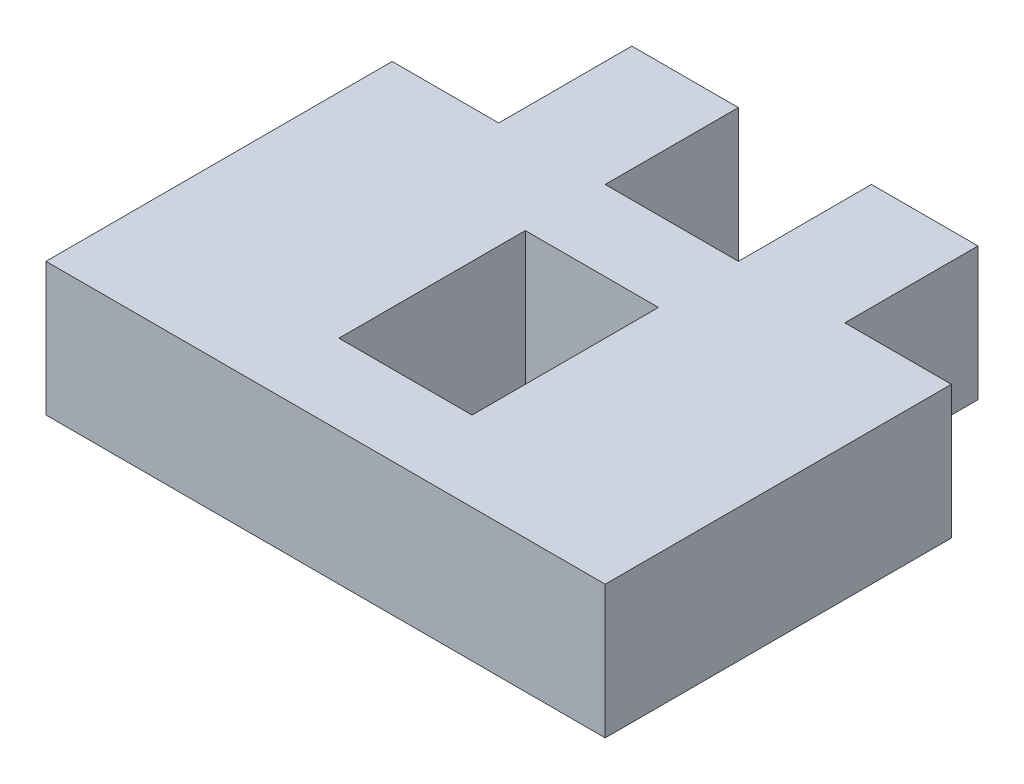
ISO-10303-21;
HEADER;
FILE_DESCRIPTION(('STEP AP214'),'2;1');
FILE_NAME('part.step','',(''),(''),'','','');
FILE_SCHEMA(('AUTOMOTIVE_DESIGN { 1 0 10303 214 1 1 1 1 }'));
ENDSEC;
DATA;
#1=APPLICATION_CONTEXT('core data for automotive mechanical design processes');
#2=APPLICATION_PROTOCOL_DEFINITION('international standard','automotive_design',2000,#1);
#3=PRODUCT_CONTEXT('',#1,'mechanical');
#4=PRODUCT('Part','Part','',(#3));
#5=PRODUCT_RELATED_PRODUCT_CATEGORY('part','',(#4));
#6=PRODUCT_DEFINITION_FORMATION('','',#4);
#7=PRODUCT_DEFINITION_CONTEXT('part definition',#1,'design');
#8=PRODUCT_DEFINITION('design','',#6,#7);
#9=PRODUCT_DEFINITION_SHAPE('','',#8);
#10=(LENGTH_UNIT() NAMED_UNIT(*) SI_UNIT(.MILLI.,.METRE.));
#11=(NAMED_UNIT(*) PLANE_ANGLE_UNIT() SI_UNIT($,.RADIAN.));
#12=(NAMED_UNIT(*) SI_UNIT($,.STERADIAN.) SOLID_ANGLE_UNIT());
#13=UNCERTAINTY_MEASURE_WITH_UNIT(LENGTH_MEASURE(1.E-05),#10,'distance_accuracy_value','');
#14=(GEOMETRIC_REPRESENTATION_CONTEXT(3) GLOBAL_UNCERTAINTY_ASSIGNED_CONTEXT((#13)) GLOBAL_UNIT_ASSIGNED_CONTEXT((#10,
#11,#12)) REPRESENTATION_CONTEXT('',''));
#15=CARTESIAN_POINT('',(0.,0.,0.));
#16=DIRECTION('',(0.,0.,1.));
#17=DIRECTION('',(1.,0.,0.));
#18=AXIS2_PLACEMENT_3D('',#15,#16,#17);
#19=CARTESIAN_POINT('',(0.,5.,-6.95454545454545));
#20=DIRECTION('',(0.,0.,1.));
#21=DIRECTION('',(1.,0.,0.));
#22=AXIS2_PLACEMENT_3D('',#19,#20,#21);
#23=PLANE('',#22);
#24=DIRECTION('',(-1.,0.,0.));
#25=VECTOR('',#24,1.);
#26=CARTESIAN_POINT('',(0.,0.,-6.95454545454545));
#27=LINE('',#26,#25);
#28=CARTESIAN_POINT('',(6.90909090909093,0.,-6.95454545454545));
#29=VERTEX_POINT('',#28);
#30=CARTESIAN_POINT('',(2.90909090909093,0.,-6.95454545454545));
#31=VERTEX_POINT('',#30);
#32=EDGE_CURVE('E180',#29,#31,#27,.T.);
#33=ORIENTED_EDGE('',*,*,#32,.T.);
#34=DIRECTION('',(0.,-1.,0.));
#35=VECTOR('',#34,1.);
#36=CARTESIAN_POINT('',(2.90909090909093,5.,-6.95454545454545));
#37=LINE('',#36,#35);
#38=CARTESIAN_POINT('',(2.90909090909093,5.,-6.95454545454545));
#39=VERTEX_POINT('',#38);
#40=EDGE_CURVE('E11',#39,#31,#37,.T.);
#41=ORIENTED_EDGE('',*,*,#40,.F.);
#42=DIRECTION('',(-1.,0.,0.));
#43=VECTOR('',#42,1.);
#44=CARTESIAN_POINT('',(0.,5.,-6.95454545454545));
#45=LINE('',#44,#43);
#46=CARTESIAN_POINT('',(6.90909090909093,5.,-6.95454545454545));
#47=VERTEX_POINT('',#46);
#48=EDGE_CURVE('E184',#47,#39,#45,.T.);
#49=ORIENTED_EDGE('',*,*,#48,.F.);
#50=DIRECTION('',(0.,-1.,0.));
#51=VECTOR('',#50,1.);
#52=CARTESIAN_POINT('',(6.90909090909093,5.,-6.95454545454545));
#53=LINE('',#52,#51);
#54=EDGE_CURVE('E215',#47,#29,#53,.T.);
#55=ORIENTED_EDGE('',*,*,#54,.T.);
#56=EDGE_LOOP('',(#33,#41,#49,#55));
#57=FACE_BOUND('',#56,.T.);
#58=ADVANCED_FACE('F35',(#57),#23,.F.);
#59=CARTESIAN_POINT('',(2.90909090909093,5.,0.));
#60=DIRECTION('',(-1.,0.,0.));
#61=DIRECTION('',(0.,0.,1.));
#62=AXIS2_PLACEMENT_3D('',#59,#60,#61);
#63=PLANE('',#62);
#64=DIRECTION('',(0.,0.,-1.));
#65=VECTOR('',#64,1.);
#66=CARTESIAN_POINT('',(2.90909090909093,0.,0.));
#67=LINE('',#66,#65);
#68=CARTESIAN_POINT('',(2.90909090909093,0.,-11.9545454545454));
#69=VERTEX_POINT('',#68);
#70=EDGE_CURVE('E218',#31,#69,#67,.T.);
#71=ORIENTED_EDGE('',*,*,#70,.T.);
#72=DIRECTION('',(0.,-1.,0.));
#73=VECTOR('',#72,1.);
#74=CARTESIAN_POINT('',(2.90909090909093,5.,-11.9545454545454));
#75=LINE('',#74,#73);
#76=CARTESIAN_POINT('',(2.90909090909093,5.,-11.9545454545454));
#77=VERTEX_POINT('',#76);
#78=EDGE_CURVE('E42',#77,#69,#75,.T.);
#79=ORIENTED_EDGE('',*,*,#78,.F.);
#80=DIRECTION('',(0.,0.,-1.));
#81=VECTOR('',#80,1.);
#82=CARTESIAN_POINT('',(2.90909090909093,5.,0.));
#83=LINE('',#82,#81);
#84=EDGE_CURVE('E187',#39,#77,#83,.T.);
#85=ORIENTED_EDGE('',*,*,#84,.F.);
#86=ORIENTED_EDGE('',*,*,#40,.T.);
#87=EDGE_LOOP('',(#71,#79,#85,#86));
#88=FACE_BOUND('',#87,.T.);
#89=ADVANCED_FACE('F272',(#88),#63,.F.);
#90=CARTESIAN_POINT('',(0.,5.,-11.9545454545454));
#91=DIRECTION('',(0.,0.,-1.));
#92=DIRECTION('',(-1.,0.,0.));
#93=AXIS2_PLACEMENT_3D('',#90,#91,#92);
#94=PLANE('',#93);
#95=DIRECTION('',(1.,0.,0.));
#96=VECTOR('',#95,1.);
#97=CARTESIAN_POINT('',(0.,0.,-11.9545454545454));
#98=LINE('',#97,#96);
#99=CARTESIAN_POINT('',(-1.09090909090907,0.,-11.9545454545454));
#100=VERTEX_POINT('',#99);
#101=EDGE_CURVE('E221',#100,#69,#98,.T.);
#102=ORIENTED_EDGE('',*,*,#101,.F.);
#103=DIRECTION('',(0.,-1.,0.));
#104=VECTOR('',#103,1.);
#105=CARTESIAN_POINT('',(-1.09090909090907,5.,-11.9545454545454));
#106=LINE('',#105,#104);
#107=CARTESIAN_POINT('',(-1.09090909090907,5.,-11.9545454545454));
#108=VERTEX_POINT('',#107);
#109=EDGE_CURVE('E265',#108,#100,#106,.T.);
#110=ORIENTED_EDGE('',*,*,#109,.F.);
#111=DIRECTION('',(1.,0.,0.));
#112=VECTOR('',#111,1.);
#113=CARTESIAN_POINT('',(0.,5.,-11.9545454545454));
#114=LINE('',#113,#112);
#115=EDGE_CURVE('E190',#108,#77,#114,.T.);
#116=ORIENTED_EDGE('',*,*,#115,.T.);
#117=ORIENTED_EDGE('',*,*,#78,.T.);
#118=EDGE_LOOP('',(#102,#110,#116,#117));
#119=FACE_BOUND('',#118,.T.);
#120=ADVANCED_FACE('F269',(#119),#94,.T.);
#121=CARTESIAN_POINT('',(-1.09090909090907,5.,0.));
#122=DIRECTION('',(1.,0.,0.));
#123=DIRECTION('',(0.,0.,-1.));
#124=AXIS2_PLACEMENT_3D('',#121,#122,#123);
#125=PLANE('',#124);
#126=DIRECTION('',(0.,0.,1.));
#127=VECTOR('',#126,1.);
#128=CARTESIAN_POINT('',(-1.09090909090907,0.,0.));
#129=LINE('',#128,#127);
#130=CARTESIAN_POINT('',(-1.09090909090907,0.,-6.95454545454545));
#131=VERTEX_POINT('',#130);
#132=EDGE_CURVE('E224',#100,#131,#129,.T.);
#133=ORIENTED_EDGE('',*,*,#132,.T.);
#134=DIRECTION('',(0.,-1.,0.));
#135=VECTOR('',#134,1.);
#136=CARTESIAN_POINT('',(-1.09090909090907,5.,-6.95454545454545));
#137=LINE('',#136,#135);
#138=CARTESIAN_POINT('',(-1.09090909090907,5.,-6.95454545454545));
#139=VERTEX_POINT('',#138);
#140=EDGE_CURVE('E263',#139,#131,#137,.T.);
#141=ORIENTED_EDGE('',*,*,#140,.F.);
#142=DIRECTION('',(0.,0.,1.));
#143=VECTOR('',#142,1.);
#144=CARTESIAN_POINT('',(-1.09090909090907,5.,0.));
#145=LINE('',#144,#143);
#146=EDGE_CURVE('E193',#108,#139,#145,.T.);
#147=ORIENTED_EDGE('',*,*,#146,.F.);
#148=ORIENTED_EDGE('',*,*,#109,.T.);
#149=EDGE_LOOP('',(#133,#141,#147,#148));
#150=FACE_BOUND('',#149,.T.);
#151=ADVANCED_FACE('F279',(#150),#125,.F.);
#152=CARTESIAN_POINT('',(0.,5.,-6.95454545454545));
#153=DIRECTION('',(0.,0.,-1.));
#154=DIRECTION('',(-1.,0.,0.));
#155=AXIS2_PLACEMENT_3D('',#152,#153,#154);
#156=PLANE('',#155);
#157=DIRECTION('',(1.,0.,0.));
#158=VECTOR('',#157,1.);
#159=CARTESIAN_POINT('',(0.,0.,-6.95454545454545));
#160=LINE('',#159,#158);
#161=CARTESIAN_POINT('',(-6.09090909090907,0.,-6.95454545454545));
#162=VERTEX_POINT('',#161);
#163=EDGE_CURVE('E228',#162,#131,#160,.T.);
#164=ORIENTED_EDGE('',*,*,#163,.F.);
#165=DIRECTION('',(0.,-1.,0.));
#166=VECTOR('',#165,1.);
#167=CARTESIAN_POINT('',(-6.09090909090907,5.,-6.95454545454545));
#168=LINE('',#167,#166);
#169=CARTESIAN_POINT('',(-6.09090909090907,5.,-6.95454545454545));
#170=VERTEX_POINT('',#169);
#171=EDGE_CURVE('E261',#170,#162,#168,.T.);
#172=ORIENTED_EDGE('',*,*,#171,.F.);
#173=DIRECTION('',(1.,0.,0.));
#174=VECTOR('',#173,1.);
#175=CARTESIAN_POINT('',(0.,5.,-6.95454545454545));
#176=LINE('',#175,#174);
#177=EDGE_CURVE('E196',#170,#139,#176,.T.);
#178=ORIENTED_EDGE('',*,*,#177,.T.);
#179=ORIENTED_EDGE('',*,*,#140,.T.);
#180=EDGE_LOOP('',(#164,#172,#178,#179));
#181=FACE_BOUND('',#180,.T.);
#182=ADVANCED_FACE('F318',(#181),#156,.T.);
#183=CARTESIAN_POINT('',(-6.09090909090907,5.,0.));
#184=DIRECTION('',(1.,0.,0.));
#185=DIRECTION('',(0.,0.,-1.));
#186=AXIS2_PLACEMENT_3D('',#183,#184,#185);
#187=PLANE('',#186);
#188=DIRECTION('',(0.,0.,1.));
#189=VECTOR('',#188,1.);
#190=CARTESIAN_POINT('',(-6.09090909090907,0.,0.));
#191=LINE('',#190,#189);
#192=CARTESIAN_POINT('',(-6.09090909090907,0.,-11.9545454545454));
#193=VERTEX_POINT('',#192);
#194=EDGE_CURVE('E231',#193,#162,#191,.T.);
#195=ORIENTED_EDGE('',*,*,#194,.F.);
#196=DIRECTION('',(0.,-1.,0.));
#197=VECTOR('',#196,1.);
#198=CARTESIAN_POINT('',(-6.09090909090907,5.,-11.9545454545454));
#199=LINE('',#198,#197);
#200=CARTESIAN_POINT('',(-6.09090909090907,5.,-11.9545454545454));
#201=VERTEX_POINT('',#200);
#202=EDGE_CURVE('E259',#201,#193,#199,.T.);
#203=ORIENTED_EDGE('',*,*,#202,.F.);
#204=DIRECTION('',(0.,0.,1.));
#205=VECTOR('',#204,1.);
#206=CARTESIAN_POINT('',(-6.09090909090907,5.,0.));
#207=LINE('',#206,#205);
#208=EDGE_CURVE('E199',#201,#170,#207,.T.);
#209=ORIENTED_EDGE('',*,*,#208,.T.);
#210=ORIENTED_EDGE('',*,*,#171,.T.);
#211=EDGE_LOOP('',(#195,#203,#209,#210));
#212=FACE_BOUND('',#211,.T.);
#213=ADVANCED_FACE('F316',(#212),#187,.T.);
#214=CARTESIAN_POINT('',(-10.0909090909091,0.,-11.9545454545455));
#215=VERTEX_POINT('',#214);
#216=EDGE_CURVE('E225',#215,#193,#98,.T.);
#217=ORIENTED_EDGE('',*,*,#216,.F.);
#218=DIRECTION('',(0.,-1.,0.));
#219=VECTOR('',#218,1.);
#220=CARTESIAN_POINT('',(-10.0909090909091,5.,-11.9545454545455));
#221=LINE('',#220,#219);
#222=CARTESIAN_POINT('',(-10.0909090909091,5.,-11.9545454545455));
#223=VERTEX_POINT('',#222);
#224=EDGE_CURVE('E257',#223,#215,#221,.T.);
#225=ORIENTED_EDGE('',*,*,#224,.F.);
#226=EDGE_CURVE('E194',#223,#201,#114,.T.);
#227=ORIENTED_EDGE('',*,*,#226,.T.);
#228=ORIENTED_EDGE('',*,*,#202,.T.);
#229=EDGE_LOOP('',(#217,#225,#227,#228));
#230=FACE_BOUND('',#229,.T.);
#231=ADVANCED_FACE('F311',(#230),#94,.T.);
#232=CARTESIAN_POINT('',(-10.0909090909091,5.,0.));
#233=DIRECTION('',(-1.,0.,0.));
#234=DIRECTION('',(0.,0.,1.));
#235=AXIS2_PLACEMENT_3D('',#232,#233,#234);
#236=PLANE('',#235);
#237=DIRECTION('',(0.,0.,-1.));
#238=VECTOR('',#237,1.);
#239=CARTESIAN_POINT('',(-10.0909090909091,0.,0.));
#240=LINE('',#239,#238);
#241=CARTESIAN_POINT('',(-10.0909090909091,0.,-6.95454545454545));
#242=VERTEX_POINT('',#241);
#243=EDGE_CURVE('E234',#242,#215,#240,.T.);
#244=ORIENTED_EDGE('',*,*,#243,.F.);
#245=DIRECTION('',(0.,-1.,0.));
#246=VECTOR('',#245,1.);
#247=CARTESIAN_POINT('',(-10.0909090909091,5.,-6.95454545454545));
#248=LINE('',#247,#246);
#249=CARTESIAN_POINT('',(-10.0909090909091,5.,-6.95454545454545));
#250=VERTEX_POINT('',#249);
#251=EDGE_CURVE('E255',#250,#242,#248,.T.);
#252=ORIENTED_EDGE('',*,*,#251,.F.);
#253=DIRECTION('',(0.,0.,-1.));
#254=VECTOR('',#253,1.);
#255=CARTESIAN_POINT('',(-10.0909090909091,5.,0.));
#256=LINE('',#255,#254);
#257=EDGE_CURVE('E202',#250,#223,#256,.T.);
#258=ORIENTED_EDGE('',*,*,#257,.T.);
#259=ORIENTED_EDGE('',*,*,#224,.T.);
#260=EDGE_LOOP('',(#244,#252,#258,#259));
#261=FACE_BOUND('',#260,.T.);
#262=ADVANCED_FACE('F306',(#261),#236,.T.);
#263=CARTESIAN_POINT('',(0.,5.,-6.95454545454545));
#264=DIRECTION('',(0.,0.,-1.));
#265=DIRECTION('',(-1.,0.,0.));
#266=AXIS2_PLACEMENT_3D('',#263,#264,#265);
#267=PLANE('',#266);
#268=DIRECTION('',(1.,0.,0.));
#269=VECTOR('',#268,1.);
#270=CARTESIAN_POINT('',(0.,0.,-6.95454545454545));
#271=LINE('',#270,#269);
#272=CARTESIAN_POINT('',(-14.0909090909091,0.,-6.95454545454545));
#273=VERTEX_POINT('',#272);
#274=EDGE_CURVE('E237',#273,#242,#271,.T.);
#275=ORIENTED_EDGE('',*,*,#274,.F.);
#276=DIRECTION('',(0.,-1.,0.));
#277=VECTOR('',#276,1.);
#278=CARTESIAN_POINT('',(-14.0909090909091,5.,-6.95454545454545));
#279=LINE('',#278,#277);
#280=CARTESIAN_POINT('',(-14.0909090909091,5.,-6.95454545454545));
#281=VERTEX_POINT('',#280);
#282=EDGE_CURVE('E253',#281,#273,#279,.T.);
#283=ORIENTED_EDGE('',*,*,#282,.F.);
#284=DIRECTION('',(1.,0.,0.));
#285=VECTOR('',#284,1.);
#286=CARTESIAN_POINT('',(0.,5.,-6.95454545454545));
#287=LINE('',#286,#285);
#288=EDGE_CURVE('E205',#281,#250,#287,.T.);
#289=ORIENTED_EDGE('',*,*,#288,.T.);
#290=ORIENTED_EDGE('',*,*,#251,.T.);
#291=EDGE_LOOP('',(#275,#283,#289,#290));
#292=FACE_BOUND('',#291,.T.);
#293=ADVANCED_FACE('F300',(#292),#267,.T.);
#294=CARTESIAN_POINT('',(-14.0909090909091,5.,0.));
#295=DIRECTION('',(1.,0.,0.));
#296=DIRECTION('',(0.,0.,-1.));
#297=AXIS2_PLACEMENT_3D('',#294,#295,#296);
#298=PLANE('',#297);
#299=DIRECTION('',(0.,0.,1.));
#300=VECTOR('',#299,1.);
#301=CARTESIAN_POINT('',(-14.0909090909091,0.,0.));
#302=LINE('',#301,#300);
#303=CARTESIAN_POINT('',(-14.0909090909091,0.,6.04545454545455));
#304=VERTEX_POINT('',#303);
#305=EDGE_CURVE('E240',#273,#304,#302,.T.);
#306=ORIENTED_EDGE('',*,*,#305,.T.);
#307=DIRECTION('',(0.,-1.,0.));
#308=VECTOR('',#307,1.);
#309=CARTESIAN_POINT('',(-14.0909090909091,5.,6.04545454545455));
#310=LINE('',#309,#308);
#311=CARTESIAN_POINT('',(-14.0909090909091,5.,6.04545454545455));
#312=VERTEX_POINT('',#311);
#313=EDGE_CURVE('E250',#312,#304,#310,.T.);
#314=ORIENTED_EDGE('',*,*,#313,.F.);
#315=DIRECTION('',(0.,0.,1.));
#316=VECTOR('',#315,1.);
#317=CARTESIAN_POINT('',(-14.0909090909091,5.,0.));
#318=LINE('',#317,#316);
#319=EDGE_CURVE('E208',#281,#312,#318,.T.);
#320=ORIENTED_EDGE('',*,*,#319,.F.);
#321=ORIENTED_EDGE('',*,*,#282,.T.);
#322=EDGE_LOOP('',(#306,#314,#320,#321));
#323=FACE_BOUND('',#322,.T.);
#324=ADVANCED_FACE('F319',(#323),#298,.F.);
#325=CARTESIAN_POINT('',(0.,5.,6.04545454545455));
#326=DIRECTION('',(0.,0.,-1.));
#327=DIRECTION('',(-1.,0.,0.));
#328=AXIS2_PLACEMENT_3D('',#325,#326,#327);
#329=PLANE('',#328);
#330=DIRECTION('',(1.,0.,0.));
#331=VECTOR('',#330,1.);
#332=CARTESIAN_POINT('',(0.,0.,6.04545454545455));
#333=LINE('',#332,#331);
#334=CARTESIAN_POINT('',(6.90909090909093,0.,6.04545454545455));
#335=VERTEX_POINT('',#334);
#336=EDGE_CURVE('E242',#304,#335,#333,.T.);
#337=ORIENTED_EDGE('',*,*,#336,.T.);
#338=DIRECTION('',(0.,-1.,0.));
#339=VECTOR('',#338,1.);
#340=CARTESIAN_POINT('',(6.90909090909093,5.,6.04545454545455));
#341=LINE('',#340,#339);
#342=CARTESIAN_POINT('',(6.90909090909093,5.,6.04545454545455));
#343=VERTEX_POINT('',#342);
#344=EDGE_CURVE('E248',#343,#335,#341,.T.);
#345=ORIENTED_EDGE('',*,*,#344,.F.);
#346=DIRECTION('',(1.,0.,0.));
#347=VECTOR('',#346,1.);
#348=CARTESIAN_POINT('',(0.,5.,6.04545454545455));
#349=LINE('',#348,#347);
#350=EDGE_CURVE('E210',#312,#343,#349,.T.);
#351=ORIENTED_EDGE('',*,*,#350,.F.);
#352=ORIENTED_EDGE('',*,*,#313,.T.);
#353=EDGE_LOOP('',(#337,#345,#351,#352));
#354=FACE_BOUND('',#353,.T.);
#355=ADVANCED_FACE('F294',(#354),#329,.F.);
#356=CARTESIAN_POINT('',(6.90909090909093,5.,0.));
#357=DIRECTION('',(1.,0.,0.));
#358=DIRECTION('',(0.,0.,-1.));
#359=AXIS2_PLACEMENT_3D('',#356,#357,#358);
#360=PLANE('',#359);
#361=DIRECTION('',(0.,0.,1.));
#362=VECTOR('',#361,1.);
#363=CARTESIAN_POINT('',(6.90909090909093,0.,0.));
#364=LINE('',#363,#362);
#365=EDGE_CURVE('E188',#29,#335,#364,.T.);
#366=ORIENTED_EDGE('',*,*,#365,.F.);
#367=ORIENTED_EDGE('',*,*,#54,.F.);
#368=DIRECTION('',(0.,0.,1.));
#369=VECTOR('',#368,1.);
#370=CARTESIAN_POINT('',(6.90909090909093,5.,0.));
#371=LINE('',#370,#369);
#372=EDGE_CURVE('E212',#47,#343,#371,.T.);
#373=ORIENTED_EDGE('',*,*,#372,.T.);
#374=ORIENTED_EDGE('',*,*,#344,.T.);
#375=EDGE_LOOP('',(#366,#367,#373,#374));
#376=FACE_BOUND('',#375,.T.);
#377=ADVANCED_FACE('F290',(#376),#360,.T.);
#378=CARTESIAN_POINT('',(0.,5.,0.));
#379=DIRECTION('',(0.,1.,0.));
#380=DIRECTION('',(0.,0.,1.));
#381=AXIS2_PLACEMENT_3D('',#378,#379,#380);
#382=PLANE('',#381);
#383=DIRECTION('',(0.,0.,1.));
#384=VECTOR('',#383,1.);
#385=CARTESIAN_POINT('',(-6.09090909090908,5.,-3.95454545454546));
#386=LINE('',#385,#384);
#387=CARTESIAN_POINT('',(-6.09090909090908,5.,-3.95454545454546));
#388=VERTEX_POINT('',#387);
#389=CARTESIAN_POINT('',(-6.09090909090907,5.,3.04545454545455));
#390=VERTEX_POINT('',#389);
#391=EDGE_CURVE('E49',#388,#390,#386,.T.);
#392=ORIENTED_EDGE('',*,*,#391,.F.);
#393=DIRECTION('',(-1.,0.,0.));
#394=VECTOR('',#393,1.);
#395=CARTESIAN_POINT('',(-6.09090909090908,5.,-3.95454545454546));
#396=LINE('',#395,#394);
#397=CARTESIAN_POINT('',(-1.09090909090908,5.,-3.95454545454546));
#398=VERTEX_POINT('',#397);
#399=EDGE_CURVE('E165',#398,#388,#396,.T.);
#400=ORIENTED_EDGE('',*,*,#399,.F.);
#401=DIRECTION('',(0.,0.,-1.));
#402=VECTOR('',#401,1.);
#403=CARTESIAN_POINT('',(-1.09090909090908,5.,-3.95454545454546));
#404=LINE('',#403,#402);
#405=CARTESIAN_POINT('',(-1.09090909090907,5.,3.04545454545455));
#406=VERTEX_POINT('',#405);
#407=EDGE_CURVE('E168',#406,#398,#404,.T.);
#408=ORIENTED_EDGE('',*,*,#407,.F.);
#409=DIRECTION('',(1.,0.,0.));
#410=VECTOR('',#409,1.);
#411=CARTESIAN_POINT('',(-6.09090909090907,5.,3.04545454545455));
#412=LINE('',#411,#410);
#413=EDGE_CURVE('E174',#390,#406,#412,.T.);
#414=ORIENTED_EDGE('',*,*,#413,.F.);
#415=EDGE_LOOP('',(#392,#400,#408,#414));
#416=FACE_BOUND('',#415,.T.);
#417=ORIENTED_EDGE('',*,*,#48,.T.);
#418=ORIENTED_EDGE('',*,*,#84,.T.);
#419=ORIENTED_EDGE('',*,*,#115,.F.);
#420=ORIENTED_EDGE('',*,*,#146,.T.);
#421=ORIENTED_EDGE('',*,*,#177,.F.);
#422=ORIENTED_EDGE('',*,*,#208,.F.);
#423=ORIENTED_EDGE('',*,*,#226,.F.);
#424=ORIENTED_EDGE('',*,*,#257,.F.);
#425=ORIENTED_EDGE('',*,*,#288,.F.);
#426=ORIENTED_EDGE('',*,*,#319,.T.);
#427=ORIENTED_EDGE('',*,*,#350,.T.);
#428=ORIENTED_EDGE('',*,*,#372,.F.);
#429=EDGE_LOOP('',(#417,#418,#419,#420,#421,#422,#423,#424,#425,#426,#427,#428));
#430=FACE_BOUND('',#429,.T.);
#431=ADVANCED_FACE('F283',(#416,#430),#382,.T.);
#432=CARTESIAN_POINT('',(0.,0.,0.));
#433=DIRECTION('',(0.,1.,0.));
#434=DIRECTION('',(0.,0.,1.));
#435=AXIS2_PLACEMENT_3D('',#432,#433,#434);
#436=PLANE('',#435);
#437=DIRECTION('',(-1.,0.,0.));
#438=VECTOR('',#437,1.);
#439=CARTESIAN_POINT('',(-6.09090909090908,0.,-3.95454545454546));
#440=LINE('',#439,#438);
#441=CARTESIAN_POINT('',(-1.09090909090908,0.,-3.95454545454546));
#442=VERTEX_POINT('',#441);
#443=CARTESIAN_POINT('',(-6.09090909090908,0.,-3.95454545454546));
#444=VERTEX_POINT('',#443);
#445=EDGE_CURVE('E155',#442,#444,#440,.T.);
#446=ORIENTED_EDGE('',*,*,#445,.T.);
#447=DIRECTION('',(0.,0.,1.));
#448=VECTOR('',#447,1.);
#449=CARTESIAN_POINT('',(-6.09090909090908,0.,-3.95454545454546));
#450=LINE('',#449,#448);
#451=CARTESIAN_POINT('',(-6.09090909090907,0.,3.04545454545455));
#452=VERTEX_POINT('',#451);
#453=EDGE_CURVE('E149',#444,#452,#450,.T.);
#454=ORIENTED_EDGE('',*,*,#453,.T.);
#455=DIRECTION('',(1.,0.,0.));
#456=VECTOR('',#455,1.);
#457=CARTESIAN_POINT('',(-6.09090909090907,0.,3.04545454545455));
#458=LINE('',#457,#456);
#459=CARTESIAN_POINT('',(-1.09090909090907,0.,3.04545454545455));
#460=VERTEX_POINT('',#459);
#461=EDGE_CURVE('E158',#452,#460,#458,.T.);
#462=ORIENTED_EDGE('',*,*,#461,.T.);
#463=DIRECTION('',(0.,0.,-1.));
#464=VECTOR('',#463,1.);
#465=CARTESIAN_POINT('',(-1.09090909090908,0.,-3.95454545454546));
#466=LINE('',#465,#464);
#467=EDGE_CURVE('E57',#460,#442,#466,.T.);
#468=ORIENTED_EDGE('',*,*,#467,.T.);
#469=EDGE_LOOP('',(#446,#454,#462,#468));
#470=FACE_BOUND('',#469,.T.);
#471=ORIENTED_EDGE('',*,*,#32,.F.);
#472=ORIENTED_EDGE('',*,*,#365,.T.);
#473=ORIENTED_EDGE('',*,*,#336,.F.);
#474=ORIENTED_EDGE('',*,*,#305,.F.);
#475=ORIENTED_EDGE('',*,*,#274,.T.);
#476=ORIENTED_EDGE('',*,*,#243,.T.);
#477=ORIENTED_EDGE('',*,*,#216,.T.);
#478=ORIENTED_EDGE('',*,*,#194,.T.);
#479=ORIENTED_EDGE('',*,*,#163,.T.);
#480=ORIENTED_EDGE('',*,*,#132,.F.);
#481=ORIENTED_EDGE('',*,*,#101,.T.);
#482=ORIENTED_EDGE('',*,*,#70,.F.);
#483=EDGE_LOOP('',(#471,#472,#473,#474,#475,#476,#477,#478,#479,#480,#481,#482));
#484=FACE_BOUND('',#483,.T.);
#485=ADVANCED_FACE('F162',(#470,#484),#436,.F.);
#486=CARTESIAN_POINT('',(-6.09090909090908,0.,-3.95454545454546));
#487=DIRECTION('',(-1.,0.,0.));
#488=DIRECTION('',(0.,0.,1.));
#489=AXIS2_PLACEMENT_3D('',#486,#487,#488);
#490=PLANE('',#489);
#491=ORIENTED_EDGE('',*,*,#391,.T.);
#492=DIRECTION('',(0.,1.,0.));
#493=VECTOR('',#492,1.);
#494=CARTESIAN_POINT('',(-6.09090909090907,0.,3.04545454545455));
#495=LINE('',#494,#493);
#496=EDGE_CURVE('E145',#452,#390,#495,.T.);
#497=ORIENTED_EDGE('',*,*,#496,.F.);
#498=ORIENTED_EDGE('',*,*,#453,.F.);
#499=DIRECTION('',(0.,1.,0.));
#500=VECTOR('',#499,1.);
#501=CARTESIAN_POINT('',(-6.09090909090908,0.,-3.95454545454546));
#502=LINE('',#501,#500);
#503=EDGE_CURVE('E178',#444,#388,#502,.T.);
#504=ORIENTED_EDGE('',*,*,#503,.T.);
#505=EDGE_LOOP('',(#491,#497,#498,#504));
#506=FACE_BOUND('',#505,.T.);
#507=ADVANCED_FACE('F147',(#506),#490,.F.);
#508=CARTESIAN_POINT('',(-6.09090909090908,0.,-3.95454545454546));
#509=DIRECTION('',(0.,0.,-1.));
#510=DIRECTION('',(-1.,0.,0.));
#511=AXIS2_PLACEMENT_3D('',#508,#509,#510);
#512=PLANE('',#511);
#513=ORIENTED_EDGE('',*,*,#399,.T.);
#514=ORIENTED_EDGE('',*,*,#503,.F.);
#515=ORIENTED_EDGE('',*,*,#445,.F.);
#516=DIRECTION('',(0.,1.,0.));
#517=VECTOR('',#516,1.);
#518=CARTESIAN_POINT('',(-1.09090909090908,0.,-3.95454545454546));
#519=LINE('',#518,#517);
#520=EDGE_CURVE('E181',#442,#398,#519,.T.);
#521=ORIENTED_EDGE('',*,*,#520,.T.);
#522=EDGE_LOOP('',(#513,#514,#515,#521));
#523=FACE_BOUND('',#522,.T.);
#524=ADVANCED_FACE('F397',(#523),#512,.F.);
#525=CARTESIAN_POINT('',(-1.09090909090908,0.,-3.95454545454546));
#526=DIRECTION('',(1.,0.,0.));
#527=DIRECTION('',(0.,0.,-1.));
#528=AXIS2_PLACEMENT_3D('',#525,#526,#527);
#529=PLANE('',#528);
#530=ORIENTED_EDGE('',*,*,#407,.T.);
#531=ORIENTED_EDGE('',*,*,#520,.F.);
#532=ORIENTED_EDGE('',*,*,#467,.F.);
#533=DIRECTION('',(0.,1.,0.));
#534=VECTOR('',#533,1.);
#535=CARTESIAN_POINT('',(-1.09090909090907,0.,3.04545454545455));
#536=LINE('',#535,#534);
#537=EDGE_CURVE('E154',#460,#406,#536,.T.);
#538=ORIENTED_EDGE('',*,*,#537,.T.);
#539=EDGE_LOOP('',(#530,#531,#532,#538));
#540=FACE_BOUND('',#539,.T.);
#541=ADVANCED_FACE('F406',(#540),#529,.F.);
#542=CARTESIAN_POINT('',(-6.09090909090907,0.,3.04545454545455));
#543=DIRECTION('',(0.,0.,1.));
#544=DIRECTION('',(1.,0.,0.));
#545=AXIS2_PLACEMENT_3D('',#542,#543,#544);
#546=PLANE('',#545);
#547=ORIENTED_EDGE('',*,*,#413,.T.);
#548=ORIENTED_EDGE('',*,*,#537,.F.);
#549=ORIENTED_EDGE('',*,*,#461,.F.);
#550=ORIENTED_EDGE('',*,*,#496,.T.);
#551=EDGE_LOOP('',(#547,#548,#549,#550));
#552=FACE_BOUND('',#551,.T.);
#553=ADVANCED_FACE('F159',(#552),#546,.F.);
#554=CLOSED_SHELL('',(#58,#89,#120,#151,#182,#213,#231,#262,#293,#324,#355,#377,#431,#485,#507,
#524,#541,#553));
#555=MANIFOLD_SOLID_BREP('B2',#554);
#556=ADVANCED_BREP_SHAPE_REPRESENTATION('',(#18,#555),#14);
#557=SHAPE_DEFINITION_REPRESENTATION(#9,#556);
ENDSEC;
END-ISO-10303-21;
